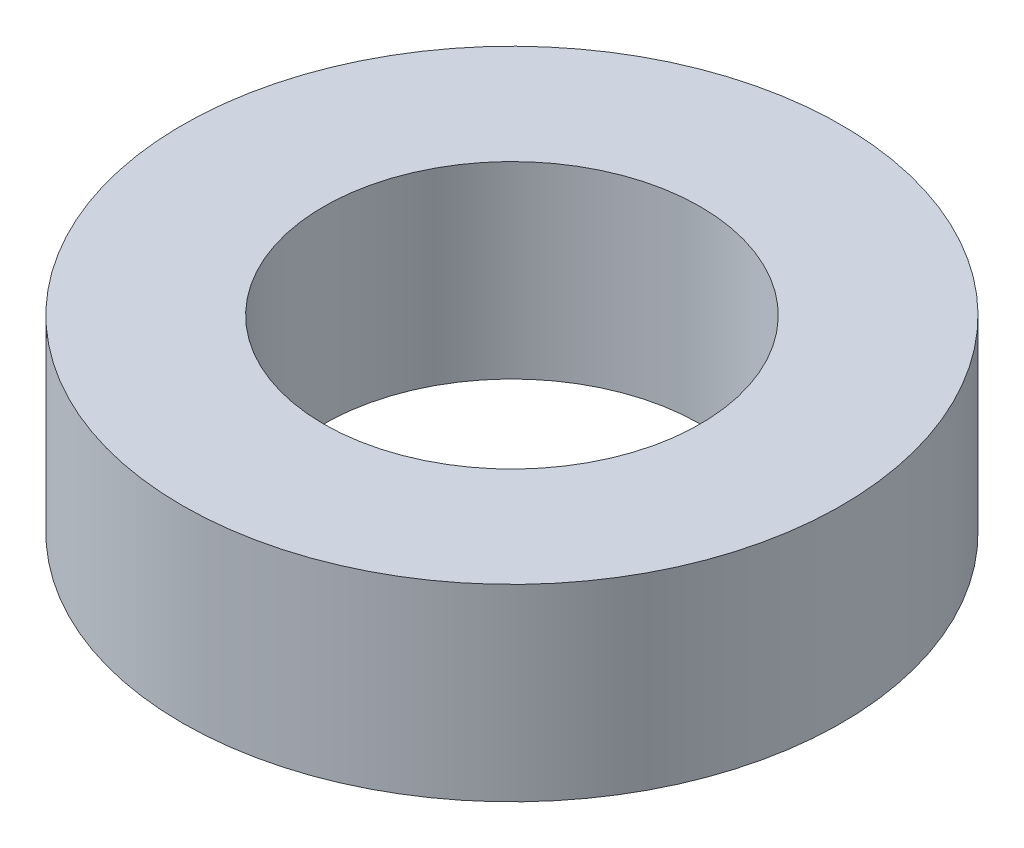
ISO-10303-21;
HEADER;
FILE_DESCRIPTION(('STEP AP214'),'2;1');
FILE_NAME('part.step','',(''),(''),'','','');
FILE_SCHEMA(('AUTOMOTIVE_DESIGN { 1 0 10303 214 1 1 1 1 }'));
ENDSEC;
DATA;
#1=APPLICATION_CONTEXT('core data for automotive mechanical design processes');
#2=APPLICATION_PROTOCOL_DEFINITION('international standard','automotive_design',2000,#1);
#3=PRODUCT_CONTEXT('',#1,'mechanical');
#4=PRODUCT('Part','Part','',(#3));
#5=PRODUCT_RELATED_PRODUCT_CATEGORY('part','',(#4));
#6=PRODUCT_DEFINITION_FORMATION('','',#4);
#7=PRODUCT_DEFINITION_CONTEXT('part definition',#1,'design');
#8=PRODUCT_DEFINITION('design','',#6,#7);
#9=PRODUCT_DEFINITION_SHAPE('','',#8);
#10=(LENGTH_UNIT() NAMED_UNIT(*) SI_UNIT(.MILLI.,.METRE.));
#11=(NAMED_UNIT(*) PLANE_ANGLE_UNIT() SI_UNIT($,.RADIAN.));
#12=(NAMED_UNIT(*) SI_UNIT($,.STERADIAN.) SOLID_ANGLE_UNIT());
#13=UNCERTAINTY_MEASURE_WITH_UNIT(LENGTH_MEASURE(1.E-05),#10,'distance_accuracy_value','');
#14=(GEOMETRIC_REPRESENTATION_CONTEXT(3) GLOBAL_UNCERTAINTY_ASSIGNED_CONTEXT((#13)) GLOBAL_UNIT_ASSIGNED_CONTEXT((#10,
#11,#12)) REPRESENTATION_CONTEXT('',''));
#15=CARTESIAN_POINT('',(0.,0.,0.));
#16=DIRECTION('',(0.,0.,1.));
#17=DIRECTION('',(1.,0.,0.));
#18=AXIS2_PLACEMENT_3D('',#15,#16,#17);
#19=CARTESIAN_POINT('',(0.,1.5875,0.));
#20=DIRECTION('',(0.,1.,0.));
#21=DIRECTION('',(0.,0.,1.));
#22=AXIS2_PLACEMENT_3D('',#19,#20,#21);
#23=PLANE('',#22);
#24=CARTESIAN_POINT('',(0.,1.5875,0.));
#25=DIRECTION('',(0.,1.,0.));
#26=DIRECTION('',(0.,0.,1.));
#27=AXIS2_PLACEMENT_3D('',#24,#25,#26);
#28=CIRCLE('',#27,2.778125);
#29=CARTESIAN_POINT('',(0.,1.5875,2.778125));
#30=VERTEX_POINT('',#29);
#31=EDGE_CURVE('E10',#30,#30,#28,.T.);
#32=ORIENTED_EDGE('',*,*,#31,.T.);
#33=EDGE_LOOP('',(#32));
#34=FACE_BOUND('',#33,.T.);
#35=CARTESIAN_POINT('',(0.,1.5875,0.));
#36=DIRECTION('',(0.,1.,0.));
#37=DIRECTION('',(0.,0.,1.));
#38=AXIS2_PLACEMENT_3D('',#35,#36,#37);
#39=CIRCLE('',#38,1.5875);
#40=CARTESIAN_POINT('',(0.,1.5875,1.5875));
#41=VERTEX_POINT('',#40);
#42=EDGE_CURVE('E42',#41,#41,#39,.T.);
#43=ORIENTED_EDGE('',*,*,#42,.F.);
#44=EDGE_LOOP('',(#43));
#45=FACE_BOUND('',#44,.T.);
#46=ADVANCED_FACE('F31',(#34,#45),#23,.T.);
#47=CARTESIAN_POINT('',(0.,0.,0.));
#48=DIRECTION('',(0.,1.,0.));
#49=DIRECTION('',(0.,0.,1.));
#50=AXIS2_PLACEMENT_3D('',#47,#48,#49);
#51=PLANE('',#50);
#52=CARTESIAN_POINT('',(0.,0.,0.));
#53=DIRECTION('',(0.,1.,0.));
#54=DIRECTION('',(0.,0.,1.));
#55=AXIS2_PLACEMENT_3D('',#52,#53,#54);
#56=CIRCLE('',#55,2.778125);
#57=CARTESIAN_POINT('',(0.,0.,2.778125));
#58=VERTEX_POINT('',#57);
#59=EDGE_CURVE('E35',#58,#58,#56,.T.);
#60=ORIENTED_EDGE('',*,*,#59,.F.);
#61=EDGE_LOOP('',(#60));
#62=FACE_BOUND('',#61,.T.);
#63=CARTESIAN_POINT('',(0.,0.,0.));
#64=DIRECTION('',(0.,1.,0.));
#65=DIRECTION('',(0.,0.,1.));
#66=AXIS2_PLACEMENT_3D('',#63,#64,#65);
#67=CIRCLE('',#66,1.5875);
#68=CARTESIAN_POINT('',(0.,0.,1.5875));
#69=VERTEX_POINT('',#68);
#70=EDGE_CURVE('E44',#69,#69,#67,.T.);
#71=ORIENTED_EDGE('',*,*,#70,.T.);
#72=EDGE_LOOP('',(#71));
#73=FACE_BOUND('',#72,.T.);
#74=ADVANCED_FACE('F54',(#62,#73),#51,.F.);
#75=CARTESIAN_POINT('',(0.,1.5875,0.));
#76=DIRECTION('',(0.,-1.,0.));
#77=DIRECTION('',(0.,0.,-1.));
#78=AXIS2_PLACEMENT_3D('',#75,#76,#77);
#79=CYLINDRICAL_SURFACE('',#78,2.778125);
#80=ORIENTED_EDGE('',*,*,#31,.F.);
#81=EDGE_LOOP('',(#80));
#82=FACE_BOUND('',#81,.T.);
#83=ORIENTED_EDGE('',*,*,#59,.T.);
#84=EDGE_LOOP('',(#83));
#85=FACE_BOUND('',#84,.T.);
#86=ADVANCED_FACE('F33',(#82,#85),#79,.T.);
#87=CARTESIAN_POINT('',(0.,1.5875,0.));
#88=DIRECTION('',(0.,-1.,0.));
#89=DIRECTION('',(0.,0.,-1.));
#90=AXIS2_PLACEMENT_3D('',#87,#88,#89);
#91=CYLINDRICAL_SURFACE('',#90,1.5875);
#92=ORIENTED_EDGE('',*,*,#42,.T.);
#93=EDGE_LOOP('',(#92));
#94=FACE_BOUND('',#93,.T.);
#95=ORIENTED_EDGE('',*,*,#70,.F.);
#96=EDGE_LOOP('',(#95));
#97=FACE_BOUND('',#96,.T.);
#98=ADVANCED_FACE('F50',(#94,#97),#91,.F.);
#99=CLOSED_SHELL('',(#46,#74,#86,#98));
#100=MANIFOLD_SOLID_BREP('B2',#99);
#101=ADVANCED_BREP_SHAPE_REPRESENTATION('',(#18,#100),#14);
#102=SHAPE_DEFINITION_REPRESENTATION(#9,#101);
ENDSEC;
END-ISO-10303-21;
